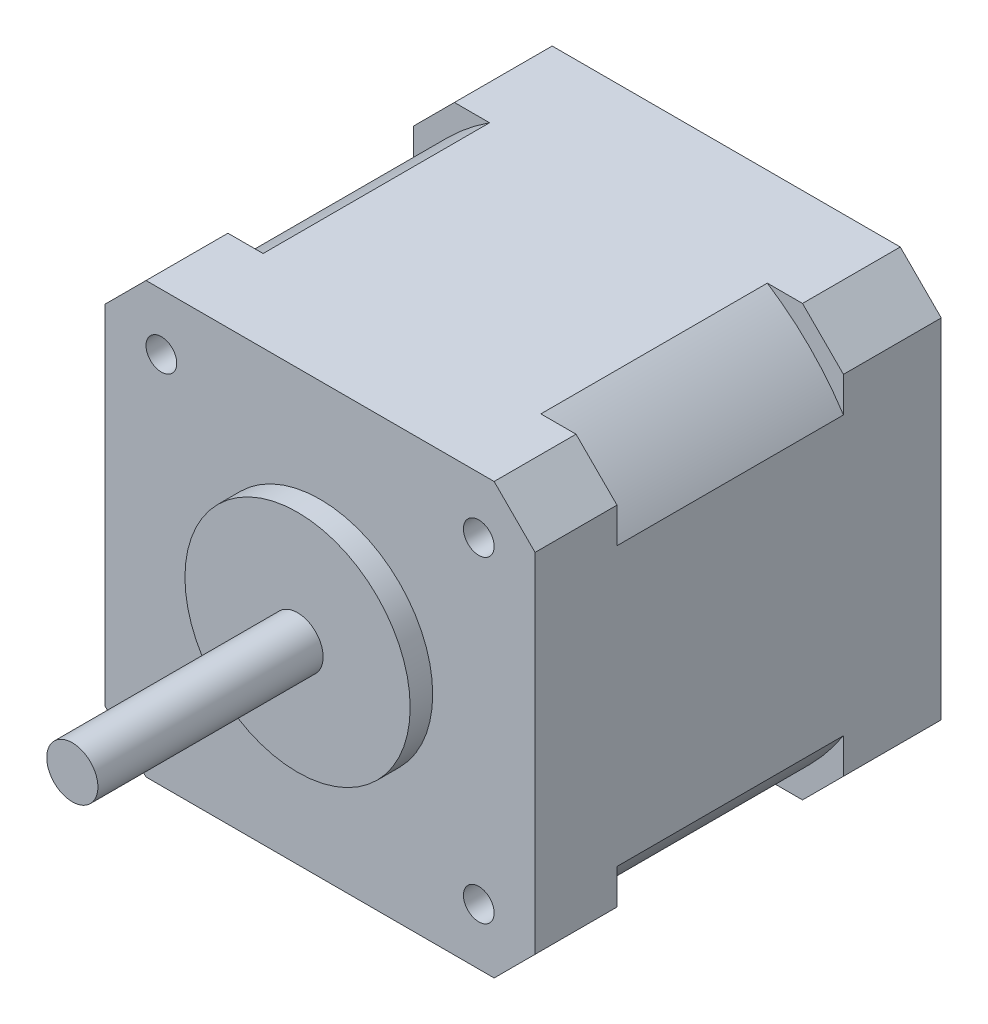
ISO-10303-21;
HEADER;
FILE_DESCRIPTION(('STEP AP214'),'2;1');
FILE_NAME('part.step','',(''),(''),'','','');
FILE_SCHEMA(('AUTOMOTIVE_DESIGN { 1 0 10303 214 1 1 1 1 }'));
ENDSEC;
DATA;
#1=APPLICATION_CONTEXT('core data for automotive mechanical design processes');
#2=APPLICATION_PROTOCOL_DEFINITION('international standard','automotive_design',2000,#1);
#3=PRODUCT_CONTEXT('',#1,'mechanical');
#4=PRODUCT('Part','Part','',(#3));
#5=PRODUCT_RELATED_PRODUCT_CATEGORY('part','',(#4));
#6=PRODUCT_DEFINITION_FORMATION('','',#4);
#7=PRODUCT_DEFINITION_CONTEXT('part definition',#1,'design');
#8=PRODUCT_DEFINITION('design','',#6,#7);
#9=PRODUCT_DEFINITION_SHAPE('','',#8);
#10=(LENGTH_UNIT() NAMED_UNIT(*) SI_UNIT(.MILLI.,.METRE.));
#11=(NAMED_UNIT(*) PLANE_ANGLE_UNIT() SI_UNIT($,.RADIAN.));
#12=(NAMED_UNIT(*) SI_UNIT($,.STERADIAN.) SOLID_ANGLE_UNIT());
#13=UNCERTAINTY_MEASURE_WITH_UNIT(LENGTH_MEASURE(1.E-05),#10,'distance_accuracy_value','');
#14=(GEOMETRIC_REPRESENTATION_CONTEXT(3) GLOBAL_UNCERTAINTY_ASSIGNED_CONTEXT((#13)) GLOBAL_UNIT_ASSIGNED_CONTEXT((#10,
#11,#12)) REPRESENTATION_CONTEXT('',''));
#15=CARTESIAN_POINT('',(0.,0.,0.));
#16=DIRECTION('',(0.,0.,1.));
#17=DIRECTION('',(1.,0.,0.));
#18=AXIS2_PLACEMENT_3D('',#15,#16,#17);
#19=CARTESIAN_POINT('',(0.,0.,2.2));
#20=DIRECTION('',(0.,0.,-1.));
#21=DIRECTION('',(-1.,0.,0.));
#22=AXIS2_PLACEMENT_3D('',#19,#20,#21);
#23=CYLINDRICAL_SURFACE('',#22,11.);
#24=CARTESIAN_POINT('',(0.,0.,2.2));
#25=DIRECTION('',(0.,0.,1.));
#26=DIRECTION('',(1.,0.,0.));
#27=AXIS2_PLACEMENT_3D('',#24,#25,#26);
#28=CIRCLE('',#27,11.);
#29=CARTESIAN_POINT('',(11.,0.,2.2));
#30=VERTEX_POINT('',#29);
#31=EDGE_CURVE('E49',#30,#30,#28,.T.);
#32=ORIENTED_EDGE('',*,*,#31,.F.);
#33=EDGE_LOOP('',(#32));
#34=FACE_BOUND('',#33,.T.);
#35=CARTESIAN_POINT('',(0.,0.,0.));
#36=DIRECTION('',(0.,0.,1.));
#37=DIRECTION('',(1.,0.,0.));
#38=AXIS2_PLACEMENT_3D('',#35,#36,#37);
#39=CIRCLE('',#38,11.);
#40=CARTESIAN_POINT('',(11.,0.,0.));
#41=VERTEX_POINT('',#40);
#42=EDGE_CURVE('E45',#41,#41,#39,.T.);
#43=ORIENTED_EDGE('',*,*,#42,.T.);
#44=EDGE_LOOP('',(#43));
#45=FACE_BOUND('',#44,.T.);
#46=ADVANCED_FACE('F42',(#34,#45),#23,.T.);
#47=CARTESIAN_POINT('',(0.,0.,2.2));
#48=DIRECTION('',(0.,0.,1.));
#49=DIRECTION('',(1.,0.,0.));
#50=AXIS2_PLACEMENT_3D('',#47,#48,#49);
#51=PLANE('',#50);
#52=CARTESIAN_POINT('',(0.,0.,2.19999999999999));
#53=DIRECTION('',(0.,0.,1.));
#54=DIRECTION('',(1.,0.,0.));
#55=AXIS2_PLACEMENT_3D('',#52,#53,#54);
#56=CIRCLE('',#55,2.5);
#57=CARTESIAN_POINT('',(2.5,0.,2.19999999999999));
#58=VERTEX_POINT('',#57);
#59=EDGE_CURVE('E12',#58,#58,#56,.T.);
#60=ORIENTED_EDGE('',*,*,#59,.F.);
#61=EDGE_LOOP('',(#60));
#62=FACE_BOUND('',#61,.T.);
#63=ORIENTED_EDGE('',*,*,#31,.T.);
#64=EDGE_LOOP('',(#63));
#65=FACE_BOUND('',#64,.T.);
#66=ADVANCED_FACE('F66',(#62,#65),#51,.T.);
#67=CARTESIAN_POINT('',(0.,0.,0.));
#68=DIRECTION('',(0.,0.,1.));
#69=DIRECTION('',(1.,0.,0.));
#70=AXIS2_PLACEMENT_3D('',#67,#68,#69);
#71=PLANE('',#70);
#72=ORIENTED_EDGE('',*,*,#42,.F.);
#73=EDGE_LOOP('',(#72));
#74=FACE_BOUND('',#73,.T.);
#75=ADVANCED_FACE('F63',(#74),#71,.F.);
#76=CARTESIAN_POINT('',(0.,0.,31.2710678118655));
#77=DIRECTION('',(0.,0.,-1.));
#78=DIRECTION('',(-1.,0.,0.));
#79=AXIS2_PLACEMENT_3D('',#76,#77,#78);
#80=CYLINDRICAL_SURFACE('',#79,2.5);
#81=ORIENTED_EDGE('',*,*,#59,.T.);
#82=EDGE_LOOP('',(#81));
#83=FACE_BOUND('',#82,.T.);
#84=CARTESIAN_POINT('',(0.,0.,24.2));
#85=DIRECTION('',(0.,0.,1.));
#86=DIRECTION('',(1.,0.,0.));
#87=AXIS2_PLACEMENT_3D('',#84,#85,#86);
#88=CIRCLE('',#87,2.5);
#89=CARTESIAN_POINT('',(2.5,0.,24.2));
#90=VERTEX_POINT('',#89);
#91=EDGE_CURVE('E55',#90,#90,#88,.T.);
#92=ORIENTED_EDGE('',*,*,#91,.F.);
#93=EDGE_LOOP('',(#92));
#94=FACE_BOUND('',#93,.T.);
#95=ADVANCED_FACE('F65',(#83,#94),#80,.T.);
#96=CARTESIAN_POINT('',(0.,0.,24.2));
#97=DIRECTION('',(0.,0.,1.));
#98=DIRECTION('',(1.,0.,0.));
#99=AXIS2_PLACEMENT_3D('',#96,#97,#98);
#100=PLANE('',#99);
#101=ORIENTED_EDGE('',*,*,#91,.T.);
#102=EDGE_LOOP('',(#101));
#103=FACE_BOUND('',#102,.T.);
#104=ADVANCED_FACE('F71',(#103),#100,.T.);
#105=CLOSED_SHELL('',(#46,#66,#75,#95,#104));
#106=MANIFOLD_SOLID_BREP('B2',#105);
#107=CARTESIAN_POINT('',(-21.,-17.,-99.06696961967));
#108=DIRECTION('',(-0.707106781186547,-0.707106781186547,0.));
#109=DIRECTION('',(0.707106781186548,-0.707106781186548,0.));
#110=AXIS2_PLACEMENT_3D('',#107,#108,#109);
#111=PLANE('',#110);
#112=DIRECTION('',(0.,0.,1.));
#113=VECTOR('',#112,1.);
#114=CARTESIAN_POINT('',(-17.,-21.,-99.06696961967));
#115=LINE('',#114,#113);
#116=CARTESIAN_POINT('',(-17.,-21.,-39.67));
#117=VERTEX_POINT('',#116);
#118=CARTESIAN_POINT('',(-17.,-21.,-30.12));
#119=VERTEX_POINT('',#118);
#120=EDGE_CURVE('E432',#117,#119,#115,.T.);
#121=ORIENTED_EDGE('',*,*,#120,.T.);
#122=DIRECTION('',(-0.707106781186548,0.707106781186548,0.));
#123=VECTOR('',#122,1.);
#124=CARTESIAN_POINT('',(-21.,-17.,-30.12));
#125=LINE('',#124,#123);
#126=CARTESIAN_POINT('',(-21.,-17.,-30.12));
#127=VERTEX_POINT('',#126);
#128=EDGE_CURVE('E348',#119,#127,#125,.T.);
#129=ORIENTED_EDGE('',*,*,#128,.T.);
#130=DIRECTION('',(0.,0.,1.));
#131=VECTOR('',#130,1.);
#132=CARTESIAN_POINT('',(-21.,-17.,-99.06696961967));
#133=LINE('',#132,#131);
#134=CARTESIAN_POINT('',(-21.,-17.,-39.67));
#135=VERTEX_POINT('',#134);
#136=EDGE_CURVE('E387',#135,#127,#133,.T.);
#137=ORIENTED_EDGE('',*,*,#136,.F.);
#138=DIRECTION('',(-0.707106781186548,0.707106781186548,0.));
#139=VECTOR('',#138,1.);
#140=CARTESIAN_POINT('',(-21.,-17.,-39.67));
#141=LINE('',#140,#139);
#142=EDGE_CURVE('E447',#117,#135,#141,.T.);
#143=ORIENTED_EDGE('',*,*,#142,.F.);
#144=EDGE_LOOP('',(#121,#129,#137,#143));
#145=FACE_BOUND('',#144,.T.);
#146=ADVANCED_FACE('F113',(#145),#111,.T.);
#147=CARTESIAN_POINT('',(-17.,21.,-99.06696961967));
#148=DIRECTION('',(-0.707106781186547,0.707106781186547,0.));
#149=DIRECTION('',(-0.707106781186548,-0.707106781186548,0.));
#150=AXIS2_PLACEMENT_3D('',#147,#148,#149);
#151=PLANE('',#150);
#152=DIRECTION('',(0.,0.,1.));
#153=VECTOR('',#152,1.);
#154=CARTESIAN_POINT('',(-21.,17.,-99.06696961967));
#155=LINE('',#154,#153);
#156=CARTESIAN_POINT('',(-21.,17.,-39.67));
#157=VERTEX_POINT('',#156);
#158=CARTESIAN_POINT('',(-21.,17.,-30.12));
#159=VERTEX_POINT('',#158);
#160=EDGE_CURVE('E380',#157,#159,#155,.T.);
#161=ORIENTED_EDGE('',*,*,#160,.T.);
#162=DIRECTION('',(0.707106781186548,0.707106781186548,0.));
#163=VECTOR('',#162,1.);
#164=CARTESIAN_POINT('',(-17.,21.,-30.12));
#165=LINE('',#164,#163);
#166=CARTESIAN_POINT('',(-17.,21.,-30.12));
#167=VERTEX_POINT('',#166);
#168=EDGE_CURVE('E356',#159,#167,#165,.T.);
#169=ORIENTED_EDGE('',*,*,#168,.T.);
#170=DIRECTION('',(0.,0.,1.));
#171=VECTOR('',#170,1.);
#172=CARTESIAN_POINT('',(-17.,21.,-99.06696961967));
#173=LINE('',#172,#171);
#174=CARTESIAN_POINT('',(-17.,21.,-39.67));
#175=VERTEX_POINT('',#174);
#176=EDGE_CURVE('E370',#175,#167,#173,.T.);
#177=ORIENTED_EDGE('',*,*,#176,.F.);
#178=DIRECTION('',(0.707106781186548,0.707106781186548,0.));
#179=VECTOR('',#178,1.);
#180=CARTESIAN_POINT('',(-17.,21.,-39.67));
#181=LINE('',#180,#179);
#182=EDGE_CURVE('E381',#157,#175,#181,.T.);
#183=ORIENTED_EDGE('',*,*,#182,.F.);
#184=EDGE_LOOP('',(#161,#169,#177,#183));
#185=FACE_BOUND('',#184,.T.);
#186=ADVANCED_FACE('F377',(#185),#151,.T.);
#187=CARTESIAN_POINT('',(21.,17.,-99.06696961967));
#188=DIRECTION('',(0.707106781186547,0.707106781186547,0.));
#189=DIRECTION('',(-0.707106781186548,0.707106781186548,0.));
#190=AXIS2_PLACEMENT_3D('',#187,#188,#189);
#191=PLANE('',#190);
#192=DIRECTION('',(0.,0.,1.));
#193=VECTOR('',#192,1.);
#194=CARTESIAN_POINT('',(17.,21.,-99.06696961967));
#195=LINE('',#194,#193);
#196=CARTESIAN_POINT('',(17.,21.,-39.67));
#197=VERTEX_POINT('',#196);
#198=CARTESIAN_POINT('',(17.,21.,-30.12));
#199=VERTEX_POINT('',#198);
#200=EDGE_CURVE('E393',#197,#199,#195,.T.);
#201=ORIENTED_EDGE('',*,*,#200,.T.);
#202=DIRECTION('',(0.707106781186548,-0.707106781186548,0.));
#203=VECTOR('',#202,1.);
#204=CARTESIAN_POINT('',(21.,17.,-30.12));
#205=LINE('',#204,#203);
#206=CARTESIAN_POINT('',(21.,17.,-30.12));
#207=VERTEX_POINT('',#206);
#208=EDGE_CURVE('E300',#199,#207,#205,.T.);
#209=ORIENTED_EDGE('',*,*,#208,.T.);
#210=DIRECTION('',(0.,0.,1.));
#211=VECTOR('',#210,1.);
#212=CARTESIAN_POINT('',(21.,17.,-99.06696961967));
#213=LINE('',#212,#211);
#214=CARTESIAN_POINT('',(21.,17.,-39.67));
#215=VERTEX_POINT('',#214);
#216=EDGE_CURVE('E299',#215,#207,#213,.T.);
#217=ORIENTED_EDGE('',*,*,#216,.F.);
#218=DIRECTION('',(0.707106781186548,-0.707106781186548,0.));
#219=VECTOR('',#218,1.);
#220=CARTESIAN_POINT('',(21.,17.,-39.67));
#221=LINE('',#220,#219);
#222=EDGE_CURVE('E438',#197,#215,#221,.T.);
#223=ORIENTED_EDGE('',*,*,#222,.F.);
#224=EDGE_LOOP('',(#201,#209,#217,#223));
#225=FACE_BOUND('',#224,.T.);
#226=ADVANCED_FACE('F568',(#225),#191,.T.);
#227=CARTESIAN_POINT('',(17.,-21.,-99.06696961967));
#228=DIRECTION('',(0.707106781186547,-0.707106781186547,0.));
#229=DIRECTION('',(0.707106781186548,0.707106781186548,0.));
#230=AXIS2_PLACEMENT_3D('',#227,#228,#229);
#231=PLANE('',#230);
#232=DIRECTION('',(0.,0.,1.));
#233=VECTOR('',#232,1.);
#234=CARTESIAN_POINT('',(21.,-17.,-99.06696961967));
#235=LINE('',#234,#233);
#236=CARTESIAN_POINT('',(21.,-17.,-39.67));
#237=VERTEX_POINT('',#236);
#238=CARTESIAN_POINT('',(21.,-17.,-30.12));
#239=VERTEX_POINT('',#238);
#240=EDGE_CURVE('E398',#237,#239,#235,.T.);
#241=ORIENTED_EDGE('',*,*,#240,.T.);
#242=DIRECTION('',(-0.707106781186548,-0.707106781186548,0.));
#243=VECTOR('',#242,1.);
#244=CARTESIAN_POINT('',(17.,-21.,-30.12));
#245=LINE('',#244,#243);
#246=CARTESIAN_POINT('',(17.,-21.,-30.12));
#247=VERTEX_POINT('',#246);
#248=EDGE_CURVE('E407',#239,#247,#245,.T.);
#249=ORIENTED_EDGE('',*,*,#248,.T.);
#250=DIRECTION('',(0.,0.,1.));
#251=VECTOR('',#250,1.);
#252=CARTESIAN_POINT('',(17.,-21.,-99.06696961967));
#253=LINE('',#252,#251);
#254=CARTESIAN_POINT('',(17.,-21.,-39.67));
#255=VERTEX_POINT('',#254);
#256=EDGE_CURVE('E401',#255,#247,#253,.T.);
#257=ORIENTED_EDGE('',*,*,#256,.F.);
#258=DIRECTION('',(-0.707106781186548,-0.707106781186548,0.));
#259=VECTOR('',#258,1.);
#260=CARTESIAN_POINT('',(17.,-21.,-39.67));
#261=LINE('',#260,#259);
#262=EDGE_CURVE('E405',#237,#255,#261,.T.);
#263=ORIENTED_EDGE('',*,*,#262,.F.);
#264=EDGE_LOOP('',(#241,#249,#257,#263));
#265=FACE_BOUND('',#264,.T.);
#266=ADVANCED_FACE('F458',(#265),#231,.T.);
#267=CARTESIAN_POINT('',(-17.,-21.,-99.06696961967));
#268=DIRECTION('',(0.,-1.,0.));
#269=DIRECTION('',(0.,0.,-1.));
#270=AXIS2_PLACEMENT_3D('',#267,#268,#269);
#271=PLANE('',#270);
#272=DIRECTION('',(-1.,0.,0.));
#273=VECTOR('',#272,1.);
#274=CARTESIAN_POINT('',(-17.,-21.,-8.00000000000001));
#275=LINE('',#274,#273);
#276=CARTESIAN_POINT('',(-13.5646599662506,-21.,-8.00000000000001));
#277=VERTEX_POINT('',#276);
#278=CARTESIAN_POINT('',(-17.,-21.,-8.00000000000001));
#279=VERTEX_POINT('',#278);
#280=EDGE_CURVE('E322',#277,#279,#275,.T.);
#281=ORIENTED_EDGE('',*,*,#280,.F.);
#282=DIRECTION('',(0.,0.,-1.));
#283=VECTOR('',#282,1.);
#284=CARTESIAN_POINT('',(-13.5646599662506,-21.,-8.00000000000001));
#285=LINE('',#284,#283);
#286=CARTESIAN_POINT('',(-13.5646599662506,-21.,-30.12));
#287=VERTEX_POINT('',#286);
#288=EDGE_CURVE('E331',#287,#277,#285,.F.);
#289=ORIENTED_EDGE('',*,*,#288,.F.);
#290=DIRECTION('',(-1.,0.,0.));
#291=VECTOR('',#290,1.);
#292=CARTESIAN_POINT('',(-17.,-21.,-30.12));
#293=LINE('',#292,#291);
#294=EDGE_CURVE('E307',#287,#119,#293,.T.);
#295=ORIENTED_EDGE('',*,*,#294,.T.);
#296=ORIENTED_EDGE('',*,*,#120,.F.);
#297=DIRECTION('',(-1.,0.,0.));
#298=VECTOR('',#297,1.);
#299=CARTESIAN_POINT('',(-17.,-21.,-39.67));
#300=LINE('',#299,#298);
#301=EDGE_CURVE('E408',#255,#117,#300,.T.);
#302=ORIENTED_EDGE('',*,*,#301,.F.);
#303=ORIENTED_EDGE('',*,*,#256,.T.);
#304=CARTESIAN_POINT('',(13.5646599662506,-21.,-30.12));
#305=VERTEX_POINT('',#304);
#306=EDGE_CURVE('E301',#247,#305,#293,.T.);
#307=ORIENTED_EDGE('',*,*,#306,.T.);
#308=DIRECTION('',(0.,0.,-1.));
#309=VECTOR('',#308,1.);
#310=CARTESIAN_POINT('',(13.5646599662506,-21.,-8.00000000000001));
#311=LINE('',#310,#309);
#312=CARTESIAN_POINT('',(13.5646599662506,-21.,-8.00000000000001));
#313=VERTEX_POINT('',#312);
#314=EDGE_CURVE('E417',#313,#305,#311,.T.);
#315=ORIENTED_EDGE('',*,*,#314,.F.);
#316=CARTESIAN_POINT('',(17.,-21.,-8.00000000000001));
#317=VERTEX_POINT('',#316);
#318=EDGE_CURVE('E337',#317,#313,#275,.T.);
#319=ORIENTED_EDGE('',*,*,#318,.F.);
#320=CARTESIAN_POINT('',(17.,-21.,0.));
#321=VERTEX_POINT('',#320);
#322=EDGE_CURVE('E404',#317,#321,#253,.T.);
#323=ORIENTED_EDGE('',*,*,#322,.T.);
#324=DIRECTION('',(1.,0.,0.));
#325=VECTOR('',#324,1.);
#326=CARTESIAN_POINT('',(-17.,-21.,0.));
#327=LINE('',#326,#325);
#328=CARTESIAN_POINT('',(-17.,-21.,0.));
#329=VERTEX_POINT('',#328);
#330=EDGE_CURVE('E531',#329,#321,#327,.T.);
#331=ORIENTED_EDGE('',*,*,#330,.F.);
#332=EDGE_CURVE('E333',#279,#329,#115,.T.);
#333=ORIENTED_EDGE('',*,*,#332,.F.);
#334=EDGE_LOOP('',(#281,#289,#295,#296,#302,#303,#307,#315,#319,#323,#331,#333));
#335=FACE_BOUND('',#334,.T.);
#336=ADVANCED_FACE('F115',(#335),#271,.T.);
#337=DIRECTION('',(-0.707106781186548,0.707106781186548,0.));
#338=VECTOR('',#337,1.);
#339=CARTESIAN_POINT('',(-21.,-17.,-8.00000000000001));
#340=LINE('',#339,#338);
#341=CARTESIAN_POINT('',(-21.,-17.,-8.00000000000001));
#342=VERTEX_POINT('',#341);
#343=EDGE_CURVE('E335',#279,#342,#340,.T.);
#344=ORIENTED_EDGE('',*,*,#343,.F.);
#345=ORIENTED_EDGE('',*,*,#332,.T.);
#346=DIRECTION('',(0.707106781186548,-0.707106781186548,0.));
#347=VECTOR('',#346,1.);
#348=CARTESIAN_POINT('',(-21.,-17.,0.));
#349=LINE('',#348,#347);
#350=CARTESIAN_POINT('',(-21.,-17.,0.));
#351=VERTEX_POINT('',#350);
#352=EDGE_CURVE('E422',#351,#329,#349,.T.);
#353=ORIENTED_EDGE('',*,*,#352,.F.);
#354=EDGE_CURVE('E384',#342,#351,#133,.T.);
#355=ORIENTED_EDGE('',*,*,#354,.F.);
#356=EDGE_LOOP('',(#344,#345,#353,#355));
#357=FACE_BOUND('',#356,.T.);
#358=ADVANCED_FACE('F556',(#357),#111,.T.);
#359=CARTESIAN_POINT('',(-21.,17.,-99.06696961967));
#360=DIRECTION('',(-1.,0.,0.));
#361=DIRECTION('',(0.,0.,1.));
#362=AXIS2_PLACEMENT_3D('',#359,#360,#361);
#363=PLANE('',#362);
#364=DIRECTION('',(0.,1.,0.));
#365=VECTOR('',#364,1.);
#366=CARTESIAN_POINT('',(-21.,17.,-8.00000000000001));
#367=LINE('',#366,#365);
#368=CARTESIAN_POINT('',(-21.,13.5646599662505,-8.00000000000001));
#369=VERTEX_POINT('',#368);
#370=CARTESIAN_POINT('',(-21.,17.,-8.00000000000001));
#371=VERTEX_POINT('',#370);
#372=EDGE_CURVE('E985',#369,#371,#367,.T.);
#373=ORIENTED_EDGE('',*,*,#372,.F.);
#374=DIRECTION('',(0.,0.,-1.));
#375=VECTOR('',#374,1.);
#376=CARTESIAN_POINT('',(-21.,13.5646599662505,-8.00000000000001));
#377=LINE('',#376,#375);
#378=CARTESIAN_POINT('',(-21.,13.5646599662505,-30.12));
#379=VERTEX_POINT('',#378);
#380=EDGE_CURVE('E966',#379,#369,#377,.F.);
#381=ORIENTED_EDGE('',*,*,#380,.F.);
#382=DIRECTION('',(0.,1.,0.));
#383=VECTOR('',#382,1.);
#384=CARTESIAN_POINT('',(-21.,17.,-30.12));
#385=LINE('',#384,#383);
#386=EDGE_CURVE('E353',#379,#159,#385,.T.);
#387=ORIENTED_EDGE('',*,*,#386,.T.);
#388=ORIENTED_EDGE('',*,*,#160,.F.);
#389=DIRECTION('',(0.,1.,0.));
#390=VECTOR('',#389,1.);
#391=CARTESIAN_POINT('',(-21.,17.,-39.67));
#392=LINE('',#391,#390);
#393=EDGE_CURVE('E446',#135,#157,#392,.T.);
#394=ORIENTED_EDGE('',*,*,#393,.F.);
#395=ORIENTED_EDGE('',*,*,#136,.T.);
#396=CARTESIAN_POINT('',(-21.,-13.5646599662505,-30.12));
#397=VERTEX_POINT('',#396);
#398=EDGE_CURVE('E352',#127,#397,#385,.T.);
#399=ORIENTED_EDGE('',*,*,#398,.T.);
#400=DIRECTION('',(0.,0.,-1.));
#401=VECTOR('',#400,1.);
#402=CARTESIAN_POINT('',(-21.,-13.5646599662505,-8.00000000000001));
#403=LINE('',#402,#401);
#404=CARTESIAN_POINT('',(-21.,-13.5646599662505,-8.00000000000001));
#405=VERTEX_POINT('',#404);
#406=EDGE_CURVE('E965',#405,#397,#403,.T.);
#407=ORIENTED_EDGE('',*,*,#406,.F.);
#408=EDGE_CURVE('E325',#342,#405,#367,.T.);
#409=ORIENTED_EDGE('',*,*,#408,.F.);
#410=ORIENTED_EDGE('',*,*,#354,.T.);
#411=DIRECTION('',(0.,-1.,0.));
#412=VECTOR('',#411,1.);
#413=CARTESIAN_POINT('',(-21.,17.,0.));
#414=LINE('',#413,#412);
#415=CARTESIAN_POINT('',(-21.,17.,0.));
#416=VERTEX_POINT('',#415);
#417=EDGE_CURVE('E424',#416,#351,#414,.T.);
#418=ORIENTED_EDGE('',*,*,#417,.F.);
#419=EDGE_CURVE('E385',#371,#416,#155,.T.);
#420=ORIENTED_EDGE('',*,*,#419,.F.);
#421=EDGE_LOOP('',(#373,#381,#387,#388,#394,#395,#399,#407,#409,#410,#418,#420));
#422=FACE_BOUND('',#421,.T.);
#423=ADVANCED_FACE('F445',(#422),#363,.T.);
#424=DIRECTION('',(0.707106781186548,0.707106781186548,0.));
#425=VECTOR('',#424,1.);
#426=CARTESIAN_POINT('',(-17.,21.,-8.00000000000001));
#427=LINE('',#426,#425);
#428=CARTESIAN_POINT('',(-17.,21.,-8.00000000000001));
#429=VERTEX_POINT('',#428);
#430=EDGE_CURVE('E554',#371,#429,#427,.T.);
#431=ORIENTED_EDGE('',*,*,#430,.F.);
#432=ORIENTED_EDGE('',*,*,#419,.T.);
#433=DIRECTION('',(-0.707106781186548,-0.707106781186548,0.));
#434=VECTOR('',#433,1.);
#435=CARTESIAN_POINT('',(-17.,21.,0.));
#436=LINE('',#435,#434);
#437=CARTESIAN_POINT('',(-17.,21.,0.));
#438=VERTEX_POINT('',#437);
#439=EDGE_CURVE('E429',#438,#416,#436,.T.);
#440=ORIENTED_EDGE('',*,*,#439,.F.);
#441=EDGE_CURVE('E392',#429,#438,#173,.T.);
#442=ORIENTED_EDGE('',*,*,#441,.F.);
#443=EDGE_LOOP('',(#431,#432,#440,#442));
#444=FACE_BOUND('',#443,.T.);
#445=ADVANCED_FACE('F552',(#444),#151,.T.);
#446=CARTESIAN_POINT('',(17.,21.,-99.06696961967));
#447=DIRECTION('',(0.,1.,0.));
#448=DIRECTION('',(0.,0.,1.));
#449=AXIS2_PLACEMENT_3D('',#446,#447,#448);
#450=PLANE('',#449);
#451=DIRECTION('',(1.,0.,0.));
#452=VECTOR('',#451,1.);
#453=CARTESIAN_POINT('',(17.,21.,-8.00000000000001));
#454=LINE('',#453,#452);
#455=CARTESIAN_POINT('',(13.5646599662505,21.,-8.00000000000001));
#456=VERTEX_POINT('',#455);
#457=CARTESIAN_POINT('',(17.,21.,-8.00000000000001));
#458=VERTEX_POINT('',#457);
#459=EDGE_CURVE('E983',#456,#458,#454,.T.);
#460=ORIENTED_EDGE('',*,*,#459,.F.);
#461=DIRECTION('',(0.,0.,-1.));
#462=VECTOR('',#461,1.);
#463=CARTESIAN_POINT('',(13.5646599662505,21.,-8.00000000000001));
#464=LINE('',#463,#462);
#465=CARTESIAN_POINT('',(13.5646599662505,21.,-30.12));
#466=VERTEX_POINT('',#465);
#467=EDGE_CURVE('E338',#466,#456,#464,.F.);
#468=ORIENTED_EDGE('',*,*,#467,.F.);
#469=DIRECTION('',(1.,0.,0.));
#470=VECTOR('',#469,1.);
#471=CARTESIAN_POINT('',(17.,21.,-30.12));
#472=LINE('',#471,#470);
#473=EDGE_CURVE('E289',#466,#199,#472,.T.);
#474=ORIENTED_EDGE('',*,*,#473,.T.);
#475=ORIENTED_EDGE('',*,*,#200,.F.);
#476=DIRECTION('',(1.,0.,0.));
#477=VECTOR('',#476,1.);
#478=CARTESIAN_POINT('',(17.,21.,-39.67));
#479=LINE('',#478,#477);
#480=EDGE_CURVE('E973',#175,#197,#479,.T.);
#481=ORIENTED_EDGE('',*,*,#480,.F.);
#482=ORIENTED_EDGE('',*,*,#176,.T.);
#483=CARTESIAN_POINT('',(-13.5646599662505,21.,-30.12));
#484=VERTEX_POINT('',#483);
#485=EDGE_CURVE('E359',#167,#484,#472,.T.);
#486=ORIENTED_EDGE('',*,*,#485,.T.);
#487=DIRECTION('',(0.,0.,-1.));
#488=VECTOR('',#487,1.);
#489=CARTESIAN_POINT('',(-13.5646599662505,21.,-8.00000000000001));
#490=LINE('',#489,#488);
#491=CARTESIAN_POINT('',(-13.5646599662505,21.,-8.00000000000001));
#492=VERTEX_POINT('',#491);
#493=EDGE_CURVE('E334',#492,#484,#490,.T.);
#494=ORIENTED_EDGE('',*,*,#493,.F.);
#495=EDGE_CURVE('E982',#429,#492,#454,.T.);
#496=ORIENTED_EDGE('',*,*,#495,.F.);
#497=ORIENTED_EDGE('',*,*,#441,.T.);
#498=DIRECTION('',(-1.,0.,0.));
#499=VECTOR('',#498,1.);
#500=CARTESIAN_POINT('',(17.,21.,0.));
#501=LINE('',#500,#499);
#502=CARTESIAN_POINT('',(17.,21.,0.));
#503=VERTEX_POINT('',#502);
#504=EDGE_CURVE('E543',#503,#438,#501,.T.);
#505=ORIENTED_EDGE('',*,*,#504,.F.);
#506=EDGE_CURVE('E395',#458,#503,#195,.T.);
#507=ORIENTED_EDGE('',*,*,#506,.F.);
#508=EDGE_LOOP('',(#460,#468,#474,#475,#481,#482,#486,#494,#496,#497,#505,#507));
#509=FACE_BOUND('',#508,.T.);
#510=ADVANCED_FACE('F366',(#509),#450,.T.);
#511=DIRECTION('',(0.707106781186548,-0.707106781186548,0.));
#512=VECTOR('',#511,1.);
#513=CARTESIAN_POINT('',(21.,17.,-8.00000000000001));
#514=LINE('',#513,#512);
#515=CARTESIAN_POINT('',(21.,17.,-8.00000000000001));
#516=VERTEX_POINT('',#515);
#517=EDGE_CURVE('E346',#458,#516,#514,.T.);
#518=ORIENTED_EDGE('',*,*,#517,.F.);
#519=ORIENTED_EDGE('',*,*,#506,.T.);
#520=DIRECTION('',(-0.707106781186548,0.707106781186548,0.));
#521=VECTOR('',#520,1.);
#522=CARTESIAN_POINT('',(21.,17.,0.));
#523=LINE('',#522,#521);
#524=CARTESIAN_POINT('',(21.,17.,0.));
#525=VERTEX_POINT('',#524);
#526=EDGE_CURVE('E540',#525,#503,#523,.T.);
#527=ORIENTED_EDGE('',*,*,#526,.F.);
#528=EDGE_CURVE('E397',#516,#525,#213,.T.);
#529=ORIENTED_EDGE('',*,*,#528,.F.);
#530=EDGE_LOOP('',(#518,#519,#527,#529));
#531=FACE_BOUND('',#530,.T.);
#532=ADVANCED_FACE('F575',(#531),#191,.T.);
#533=CARTESIAN_POINT('',(21.,-17.,-99.06696961967));
#534=DIRECTION('',(1.,0.,0.));
#535=DIRECTION('',(0.,0.,-1.));
#536=AXIS2_PLACEMENT_3D('',#533,#534,#535);
#537=PLANE('',#536);
#538=DIRECTION('',(0.,-1.,0.));
#539=VECTOR('',#538,1.);
#540=CARTESIAN_POINT('',(21.,-17.,-8.00000000000001));
#541=LINE('',#540,#539);
#542=CARTESIAN_POINT('',(21.,-13.5646599662505,-8.00000000000001));
#543=VERTEX_POINT('',#542);
#544=CARTESIAN_POINT('',(21.,-17.,-8.00000000000001));
#545=VERTEX_POINT('',#544);
#546=EDGE_CURVE('E344',#543,#545,#541,.T.);
#547=ORIENTED_EDGE('',*,*,#546,.F.);
#548=DIRECTION('',(0.,0.,-1.));
#549=VECTOR('',#548,1.);
#550=CARTESIAN_POINT('',(21.,-13.5646599662505,-8.00000000000001));
#551=LINE('',#550,#549);
#552=CARTESIAN_POINT('',(21.,-13.5646599662505,-30.12));
#553=VERTEX_POINT('',#552);
#554=EDGE_CURVE('E40',#553,#543,#551,.F.);
#555=ORIENTED_EDGE('',*,*,#554,.F.);
#556=DIRECTION('',(0.,-1.,0.));
#557=VECTOR('',#556,1.);
#558=CARTESIAN_POINT('',(21.,-17.,-30.12));
#559=LINE('',#558,#557);
#560=EDGE_CURVE('E303',#553,#239,#559,.T.);
#561=ORIENTED_EDGE('',*,*,#560,.T.);
#562=ORIENTED_EDGE('',*,*,#240,.F.);
#563=DIRECTION('',(0.,-1.,0.));
#564=VECTOR('',#563,1.);
#565=CARTESIAN_POINT('',(21.,-17.,-39.67));
#566=LINE('',#565,#564);
#567=EDGE_CURVE('E434',#215,#237,#566,.T.);
#568=ORIENTED_EDGE('',*,*,#567,.F.);
#569=ORIENTED_EDGE('',*,*,#216,.T.);
#570=CARTESIAN_POINT('',(21.,13.5646599662505,-30.12));
#571=VERTEX_POINT('',#570);
#572=EDGE_CURVE('E286',#207,#571,#559,.T.);
#573=ORIENTED_EDGE('',*,*,#572,.T.);
#574=DIRECTION('',(0.,0.,-1.));
#575=VECTOR('',#574,1.);
#576=CARTESIAN_POINT('',(21.,13.5646599662505,-8.00000000000001));
#577=LINE('',#576,#575);
#578=CARTESIAN_POINT('',(21.,13.5646599662505,-8.00000000000001));
#579=VERTEX_POINT('',#578);
#580=EDGE_CURVE('E121',#579,#571,#577,.T.);
#581=ORIENTED_EDGE('',*,*,#580,.F.);
#582=EDGE_CURVE('E343',#516,#579,#541,.T.);
#583=ORIENTED_EDGE('',*,*,#582,.F.);
#584=ORIENTED_EDGE('',*,*,#528,.T.);
#585=DIRECTION('',(0.,1.,0.));
#586=VECTOR('',#585,1.);
#587=CARTESIAN_POINT('',(21.,-17.,0.));
#588=LINE('',#587,#586);
#589=CARTESIAN_POINT('',(21.,-17.,0.));
#590=VERTEX_POINT('',#589);
#591=EDGE_CURVE('E534',#590,#525,#588,.T.);
#592=ORIENTED_EDGE('',*,*,#591,.F.);
#593=EDGE_CURVE('E400',#545,#590,#235,.T.);
#594=ORIENTED_EDGE('',*,*,#593,.F.);
#595=EDGE_LOOP('',(#547,#555,#561,#562,#568,#569,#573,#581,#583,#584,#592,#594));
#596=FACE_BOUND('',#595,.T.);
#597=ADVANCED_FACE('F296',(#596),#537,.T.);
#598=DIRECTION('',(-0.707106781186548,-0.707106781186548,0.));
#599=VECTOR('',#598,1.);
#600=CARTESIAN_POINT('',(17.,-21.,-8.00000000000001));
#601=LINE('',#600,#599);
#602=EDGE_CURVE('E283',#545,#317,#601,.T.);
#603=ORIENTED_EDGE('',*,*,#602,.F.);
#604=ORIENTED_EDGE('',*,*,#593,.T.);
#605=DIRECTION('',(0.707106781186548,0.707106781186548,0.));
#606=VECTOR('',#605,1.);
#607=CARTESIAN_POINT('',(17.,-21.,0.));
#608=LINE('',#607,#606);
#609=EDGE_CURVE('E420',#321,#590,#608,.T.);
#610=ORIENTED_EDGE('',*,*,#609,.F.);
#611=ORIENTED_EDGE('',*,*,#322,.F.);
#612=EDGE_LOOP('',(#603,#604,#610,#611));
#613=FACE_BOUND('',#612,.T.);
#614=ADVANCED_FACE('F418',(#613),#231,.T.);
#615=CARTESIAN_POINT('',(0.,0.,0.));
#616=DIRECTION('',(0.,0.,1.));
#617=DIRECTION('',(1.,0.,0.));
#618=AXIS2_PLACEMENT_3D('',#615,#616,#617);
#619=PLANE('',#618);
#620=CARTESIAN_POINT('',(15.5,15.5,0.));
#621=DIRECTION('',(0.,0.,1.));
#622=DIRECTION('',(1.,0.,0.));
#623=AXIS2_PLACEMENT_3D('',#620,#621,#622);
#624=CIRCLE('',#623,1.5);
#625=CARTESIAN_POINT('',(17.,15.5,0.));
#626=VERTEX_POINT('',#625);
#627=EDGE_CURVE('E507',#626,#626,#624,.T.);
#628=ORIENTED_EDGE('',*,*,#627,.F.);
#629=EDGE_LOOP('',(#628));
#630=FACE_BOUND('',#629,.T.);
#631=CARTESIAN_POINT('',(-15.5,15.5,0.));
#632=DIRECTION('',(0.,0.,1.));
#633=DIRECTION('',(1.,0.,0.));
#634=AXIS2_PLACEMENT_3D('',#631,#632,#633);
#635=CIRCLE('',#634,1.5);
#636=CARTESIAN_POINT('',(-14.,15.5,0.));
#637=VERTEX_POINT('',#636);
#638=EDGE_CURVE('E513',#637,#637,#635,.T.);
#639=ORIENTED_EDGE('',*,*,#638,.F.);
#640=EDGE_LOOP('',(#639));
#641=FACE_BOUND('',#640,.T.);
#642=CARTESIAN_POINT('',(-15.5,-15.5,0.));
#643=DIRECTION('',(0.,0.,1.));
#644=DIRECTION('',(1.,0.,0.));
#645=AXIS2_PLACEMENT_3D('',#642,#643,#644);
#646=CIRCLE('',#645,1.5);
#647=CARTESIAN_POINT('',(-14.,-15.5,0.));
#648=VERTEX_POINT('',#647);
#649=EDGE_CURVE('E501',#648,#648,#646,.T.);
#650=ORIENTED_EDGE('',*,*,#649,.F.);
#651=EDGE_LOOP('',(#650));
#652=FACE_BOUND('',#651,.T.);
#653=CARTESIAN_POINT('',(15.5,-15.5,0.));
#654=DIRECTION('',(0.,0.,1.));
#655=DIRECTION('',(1.,0.,0.));
#656=AXIS2_PLACEMENT_3D('',#653,#654,#655);
#657=CIRCLE('',#656,1.5);
#658=CARTESIAN_POINT('',(17.,-15.5,0.));
#659=VERTEX_POINT('',#658);
#660=EDGE_CURVE('E498',#659,#659,#657,.T.);
#661=ORIENTED_EDGE('',*,*,#660,.F.);
#662=EDGE_LOOP('',(#661));
#663=FACE_BOUND('',#662,.T.);
#664=ORIENTED_EDGE('',*,*,#330,.T.);
#665=ORIENTED_EDGE('',*,*,#609,.T.);
#666=ORIENTED_EDGE('',*,*,#591,.T.);
#667=ORIENTED_EDGE('',*,*,#526,.T.);
#668=ORIENTED_EDGE('',*,*,#504,.T.);
#669=ORIENTED_EDGE('',*,*,#439,.T.);
#670=ORIENTED_EDGE('',*,*,#417,.T.);
#671=ORIENTED_EDGE('',*,*,#352,.T.);
#672=EDGE_LOOP('',(#664,#665,#666,#667,#668,#669,#670,#671));
#673=FACE_BOUND('',#672,.T.);
#674=ADVANCED_FACE('F524',(#630,#641,#652,#663,#673),#619,.T.);
#675=CARTESIAN_POINT('',(0.,0.,-39.67));
#676=DIRECTION('',(0.,0.,1.));
#677=DIRECTION('',(1.,0.,0.));
#678=AXIS2_PLACEMENT_3D('',#675,#676,#677);
#679=PLANE('',#678);
#680=CARTESIAN_POINT('',(0.,0.,-39.67));
#681=DIRECTION('',(0.,0.,-1.));
#682=DIRECTION('',(0.,1.,0.));
#683=AXIS2_PLACEMENT_3D('',#680,#681,#682);
#684=CIRCLE('',#683,4.75);
#685=CARTESIAN_POINT('',(0.,4.75000000000001,-39.67));
#686=VERTEX_POINT('',#685);
#687=EDGE_CURVE('E492',#686,#686,#684,.T.);
#688=ORIENTED_EDGE('',*,*,#687,.F.);
#689=EDGE_LOOP('',(#688));
#690=FACE_BOUND('',#689,.T.);
#691=CARTESIAN_POINT('',(-15.5,-15.5,-39.67));
#692=DIRECTION('',(0.,0.,-1.));
#693=DIRECTION('',(0.,1.,0.));
#694=AXIS2_PLACEMENT_3D('',#691,#692,#693);
#695=CIRCLE('',#694,1.5);
#696=CARTESIAN_POINT('',(-15.5,-14.,-39.67));
#697=VERTEX_POINT('',#696);
#698=EDGE_CURVE('E472',#697,#697,#695,.T.);
#699=ORIENTED_EDGE('',*,*,#698,.F.);
#700=EDGE_LOOP('',(#699));
#701=FACE_BOUND('',#700,.T.);
#702=CARTESIAN_POINT('',(15.5,15.5,-39.67));
#703=DIRECTION('',(0.,0.,-1.));
#704=DIRECTION('',(0.,1.,0.));
#705=AXIS2_PLACEMENT_3D('',#702,#703,#704);
#706=CIRCLE('',#705,1.5);
#707=CARTESIAN_POINT('',(15.5,17.,-39.67));
#708=VERTEX_POINT('',#707);
#709=EDGE_CURVE('E477',#708,#708,#706,.T.);
#710=ORIENTED_EDGE('',*,*,#709,.F.);
#711=EDGE_LOOP('',(#710));
#712=FACE_BOUND('',#711,.T.);
#713=CARTESIAN_POINT('',(15.5,-15.5,-39.67));
#714=DIRECTION('',(0.,0.,-1.));
#715=DIRECTION('',(0.,1.,0.));
#716=AXIS2_PLACEMENT_3D('',#713,#714,#715);
#717=CIRCLE('',#716,1.5);
#718=CARTESIAN_POINT('',(15.5,-14.,-39.67));
#719=VERTEX_POINT('',#718);
#720=EDGE_CURVE('E478',#719,#719,#717,.T.);
#721=ORIENTED_EDGE('',*,*,#720,.F.);
#722=EDGE_LOOP('',(#721));
#723=FACE_BOUND('',#722,.T.);
#724=CARTESIAN_POINT('',(-15.5,15.5,-39.67));
#725=DIRECTION('',(0.,0.,-1.));
#726=DIRECTION('',(0.,1.,0.));
#727=AXIS2_PLACEMENT_3D('',#724,#725,#726);
#728=CIRCLE('',#727,1.5);
#729=CARTESIAN_POINT('',(-15.5,17.,-39.67));
#730=VERTEX_POINT('',#729);
#731=EDGE_CURVE('E467',#730,#730,#728,.T.);
#732=ORIENTED_EDGE('',*,*,#731,.F.);
#733=EDGE_LOOP('',(#732));
#734=FACE_BOUND('',#733,.T.);
#735=ORIENTED_EDGE('',*,*,#301,.T.);
#736=ORIENTED_EDGE('',*,*,#142,.T.);
#737=ORIENTED_EDGE('',*,*,#393,.T.);
#738=ORIENTED_EDGE('',*,*,#182,.T.);
#739=ORIENTED_EDGE('',*,*,#480,.T.);
#740=ORIENTED_EDGE('',*,*,#222,.T.);
#741=ORIENTED_EDGE('',*,*,#567,.T.);
#742=ORIENTED_EDGE('',*,*,#262,.T.);
#743=EDGE_LOOP('',(#735,#736,#737,#738,#739,#740,#741,#742));
#744=FACE_BOUND('',#743,.T.);
#745=ADVANCED_FACE('F527',(#690,#701,#712,#723,#734,#744),#679,.F.);
#746=CARTESIAN_POINT('',(0.,0.,-30.12));
#747=DIRECTION('',(0.,0.,1.));
#748=DIRECTION('',(1.,0.,0.));
#749=AXIS2_PLACEMENT_3D('',#746,#747,#748);
#750=PLANE('',#749);
#751=ORIENTED_EDGE('',*,*,#248,.F.);
#752=ORIENTED_EDGE('',*,*,#560,.F.);
#753=CARTESIAN_POINT('',(0.,0.,-30.12));
#754=DIRECTION('',(0.,0.,1.));
#755=DIRECTION('',(1.,0.,0.));
#756=AXIS2_PLACEMENT_3D('',#753,#754,#755);
#757=CIRCLE('',#756,25.);
#758=EDGE_CURVE('E293',#305,#553,#757,.T.);
#759=ORIENTED_EDGE('',*,*,#758,.F.);
#760=ORIENTED_EDGE('',*,*,#306,.F.);
#761=EDGE_LOOP('',(#751,#752,#759,#760));
#762=FACE_BOUND('',#761,.T.);
#763=ADVANCED_FACE('F460',(#762),#750,.T.);
#764=CARTESIAN_POINT('',(0.,0.,-8.00000000000001));
#765=DIRECTION('',(0.,0.,1.));
#766=DIRECTION('',(1.,0.,0.));
#767=AXIS2_PLACEMENT_3D('',#764,#765,#766);
#768=PLANE('',#767);
#769=ORIENTED_EDGE('',*,*,#318,.T.);
#770=CARTESIAN_POINT('',(0.,0.,-8.00000000000001));
#771=DIRECTION('',(0.,0.,1.));
#772=DIRECTION('',(1.,0.,0.));
#773=AXIS2_PLACEMENT_3D('',#770,#771,#772);
#774=CIRCLE('',#773,25.);
#775=EDGE_CURVE('E290',#313,#543,#774,.T.);
#776=ORIENTED_EDGE('',*,*,#775,.T.);
#777=ORIENTED_EDGE('',*,*,#546,.T.);
#778=ORIENTED_EDGE('',*,*,#602,.T.);
#779=EDGE_LOOP('',(#769,#776,#777,#778));
#780=FACE_BOUND('',#779,.T.);
#781=ADVANCED_FACE('F411',(#780),#768,.F.);
#782=CARTESIAN_POINT('',(0.,0.,-8.00000000000001));
#783=DIRECTION('',(0.,0.,-1.));
#784=DIRECTION('',(-1.,0.,0.));
#785=AXIS2_PLACEMENT_3D('',#782,#783,#784);
#786=CYLINDRICAL_SURFACE('',#785,25.);
#787=ORIENTED_EDGE('',*,*,#314,.T.);
#788=ORIENTED_EDGE('',*,*,#758,.T.);
#789=ORIENTED_EDGE('',*,*,#554,.T.);
#790=ORIENTED_EDGE('',*,*,#775,.F.);
#791=EDGE_LOOP('',(#787,#788,#789,#790));
#792=FACE_BOUND('',#791,.T.);
#793=ADVANCED_FACE('F654',(#792),#786,.T.);
#794=ORIENTED_EDGE('',*,*,#467,.T.);
#795=EDGE_CURVE('E278',#579,#456,#774,.T.);
#796=ORIENTED_EDGE('',*,*,#795,.F.);
#797=ORIENTED_EDGE('',*,*,#580,.T.);
#798=EDGE_CURVE('E275',#571,#466,#757,.T.);
#799=ORIENTED_EDGE('',*,*,#798,.T.);
#800=EDGE_LOOP('',(#794,#796,#797,#799));
#801=FACE_BOUND('',#800,.T.);
#802=ADVANCED_FACE('F274',(#801),#786,.T.);
#803=ORIENTED_EDGE('',*,*,#798,.F.);
#804=ORIENTED_EDGE('',*,*,#572,.F.);
#805=ORIENTED_EDGE('',*,*,#208,.F.);
#806=ORIENTED_EDGE('',*,*,#473,.F.);
#807=EDGE_LOOP('',(#803,#804,#805,#806));
#808=FACE_BOUND('',#807,.T.);
#809=ADVANCED_FACE('F285',(#808),#750,.T.);
#810=ORIENTED_EDGE('',*,*,#459,.T.);
#811=ORIENTED_EDGE('',*,*,#517,.T.);
#812=ORIENTED_EDGE('',*,*,#582,.T.);
#813=ORIENTED_EDGE('',*,*,#795,.T.);
#814=EDGE_LOOP('',(#810,#811,#812,#813));
#815=FACE_BOUND('',#814,.T.);
#816=ADVANCED_FACE('F656',(#815),#768,.F.);
#817=ORIENTED_EDGE('',*,*,#380,.T.);
#818=EDGE_CURVE('E136',#492,#369,#774,.T.);
#819=ORIENTED_EDGE('',*,*,#818,.F.);
#820=ORIENTED_EDGE('',*,*,#493,.T.);
#821=EDGE_CURVE('E291',#484,#379,#757,.T.);
#822=ORIENTED_EDGE('',*,*,#821,.T.);
#823=EDGE_LOOP('',(#817,#819,#820,#822));
#824=FACE_BOUND('',#823,.T.);
#825=ADVANCED_FACE('F673',(#824),#786,.T.);
#826=ORIENTED_EDGE('',*,*,#821,.F.);
#827=ORIENTED_EDGE('',*,*,#485,.F.);
#828=ORIENTED_EDGE('',*,*,#168,.F.);
#829=ORIENTED_EDGE('',*,*,#386,.F.);
#830=EDGE_LOOP('',(#826,#827,#828,#829));
#831=FACE_BOUND('',#830,.T.);
#832=ADVANCED_FACE('F373',(#831),#750,.T.);
#833=ORIENTED_EDGE('',*,*,#372,.T.);
#834=ORIENTED_EDGE('',*,*,#430,.T.);
#835=ORIENTED_EDGE('',*,*,#495,.T.);
#836=ORIENTED_EDGE('',*,*,#818,.T.);
#837=EDGE_LOOP('',(#833,#834,#835,#836));
#838=FACE_BOUND('',#837,.T.);
#839=ADVANCED_FACE('F688',(#838),#768,.F.);
#840=ORIENTED_EDGE('',*,*,#288,.T.);
#841=EDGE_CURVE('E128',#405,#277,#774,.T.);
#842=ORIENTED_EDGE('',*,*,#841,.F.);
#843=ORIENTED_EDGE('',*,*,#406,.T.);
#844=EDGE_CURVE('E464',#397,#287,#757,.T.);
#845=ORIENTED_EDGE('',*,*,#844,.T.);
#846=EDGE_LOOP('',(#840,#842,#843,#845));
#847=FACE_BOUND('',#846,.T.);
#848=ADVANCED_FACE('F665',(#847),#786,.T.);
#849=ORIENTED_EDGE('',*,*,#280,.T.);
#850=ORIENTED_EDGE('',*,*,#343,.T.);
#851=ORIENTED_EDGE('',*,*,#408,.T.);
#852=ORIENTED_EDGE('',*,*,#841,.T.);
#853=EDGE_LOOP('',(#849,#850,#851,#852));
#854=FACE_BOUND('',#853,.T.);
#855=ADVANCED_FACE('F321',(#854),#768,.F.);
#856=ORIENTED_EDGE('',*,*,#844,.F.);
#857=ORIENTED_EDGE('',*,*,#398,.F.);
#858=ORIENTED_EDGE('',*,*,#128,.F.);
#859=ORIENTED_EDGE('',*,*,#294,.F.);
#860=EDGE_LOOP('',(#856,#857,#858,#859));
#861=FACE_BOUND('',#860,.T.);
#862=ADVANCED_FACE('F450',(#861),#750,.T.);
#863=CARTESIAN_POINT('',(-15.5,15.5,-34.67));
#864=DIRECTION('',(0.,0.,-1.));
#865=DIRECTION('',(0.,1.,0.));
#866=AXIS2_PLACEMENT_3D('',#863,#864,#865);
#867=CYLINDRICAL_SURFACE('',#866,1.5);
#868=CARTESIAN_POINT('',(-15.5,15.5,-34.67));
#869=DIRECTION('',(0.,0.,-1.));
#870=DIRECTION('',(0.,1.,0.));
#871=AXIS2_PLACEMENT_3D('',#868,#869,#870);
#872=CIRCLE('',#871,1.5);
#873=CARTESIAN_POINT('',(-15.5,17.,-34.67));
#874=VERTEX_POINT('',#873);
#875=EDGE_CURVE('E465',#874,#874,#872,.T.);
#876=ORIENTED_EDGE('',*,*,#875,.F.);
#877=EDGE_LOOP('',(#876));
#878=FACE_BOUND('',#877,.T.);
#879=ORIENTED_EDGE('',*,*,#731,.T.);
#880=EDGE_LOOP('',(#879));
#881=FACE_BOUND('',#880,.T.);
#882=ADVANCED_FACE('F732',(#878,#881),#867,.F.);
#883=CARTESIAN_POINT('',(-15.5,15.5,-34.67));
#884=DIRECTION('',(0.,0.,-1.));
#885=DIRECTION('',(0.,1.,0.));
#886=AXIS2_PLACEMENT_3D('',#883,#884,#885);
#887=PLANE('',#886);
#888=ORIENTED_EDGE('',*,*,#875,.T.);
#889=EDGE_LOOP('',(#888));
#890=FACE_BOUND('',#889,.T.);
#891=ADVANCED_FACE('F740',(#890),#887,.T.);
#892=CARTESIAN_POINT('',(15.5,-15.5,-34.67));
#893=DIRECTION('',(0.,0.,-1.));
#894=DIRECTION('',(0.,1.,0.));
#895=AXIS2_PLACEMENT_3D('',#892,#893,#894);
#896=CYLINDRICAL_SURFACE('',#895,1.5);
#897=CARTESIAN_POINT('',(15.5,-15.5,-34.67));
#898=DIRECTION('',(0.,0.,-1.));
#899=DIRECTION('',(0.,1.,0.));
#900=AXIS2_PLACEMENT_3D('',#897,#898,#899);
#901=CIRCLE('',#900,1.5);
#902=CARTESIAN_POINT('',(15.5,-14.,-34.67));
#903=VERTEX_POINT('',#902);
#904=EDGE_CURVE('E486',#903,#903,#901,.T.);
#905=ORIENTED_EDGE('',*,*,#904,.F.);
#906=EDGE_LOOP('',(#905));
#907=FACE_BOUND('',#906,.T.);
#908=ORIENTED_EDGE('',*,*,#720,.T.);
#909=EDGE_LOOP('',(#908));
#910=FACE_BOUND('',#909,.T.);
#911=ADVANCED_FACE('F750',(#907,#910),#896,.F.);
#912=CARTESIAN_POINT('',(15.5,-15.5,-34.67));
#913=DIRECTION('',(0.,0.,-1.));
#914=DIRECTION('',(0.,1.,0.));
#915=AXIS2_PLACEMENT_3D('',#912,#913,#914);
#916=PLANE('',#915);
#917=ORIENTED_EDGE('',*,*,#904,.T.);
#918=EDGE_LOOP('',(#917));
#919=FACE_BOUND('',#918,.T.);
#920=ADVANCED_FACE('F759',(#919),#916,.T.);
#921=CARTESIAN_POINT('',(15.5,15.5,-34.67));
#922=DIRECTION('',(0.,0.,-1.));
#923=DIRECTION('',(0.,1.,0.));
#924=AXIS2_PLACEMENT_3D('',#921,#922,#923);
#925=CYLINDRICAL_SURFACE('',#924,1.5);
#926=CARTESIAN_POINT('',(15.5,15.5,-34.67));
#927=DIRECTION('',(0.,0.,-1.));
#928=DIRECTION('',(0.,1.,0.));
#929=AXIS2_PLACEMENT_3D('',#926,#927,#928);
#930=CIRCLE('',#929,1.5);
#931=CARTESIAN_POINT('',(15.5,17.,-34.67));
#932=VERTEX_POINT('',#931);
#933=EDGE_CURVE('E474',#932,#932,#930,.T.);
#934=ORIENTED_EDGE('',*,*,#933,.F.);
#935=EDGE_LOOP('',(#934));
#936=FACE_BOUND('',#935,.T.);
#937=ORIENTED_EDGE('',*,*,#709,.T.);
#938=EDGE_LOOP('',(#937));
#939=FACE_BOUND('',#938,.T.);
#940=ADVANCED_FACE('F769',(#936,#939),#925,.F.);
#941=CARTESIAN_POINT('',(15.5,15.5,-34.67));
#942=DIRECTION('',(0.,0.,-1.));
#943=DIRECTION('',(0.,1.,0.));
#944=AXIS2_PLACEMENT_3D('',#941,#942,#943);
#945=PLANE('',#944);
#946=ORIENTED_EDGE('',*,*,#933,.T.);
#947=EDGE_LOOP('',(#946));
#948=FACE_BOUND('',#947,.T.);
#949=ADVANCED_FACE('F779',(#948),#945,.T.);
#950=CARTESIAN_POINT('',(-15.5,-15.5,-34.67));
#951=DIRECTION('',(0.,0.,-1.));
#952=DIRECTION('',(0.,1.,0.));
#953=AXIS2_PLACEMENT_3D('',#950,#951,#952);
#954=CYLINDRICAL_SURFACE('',#953,1.5);
#955=CARTESIAN_POINT('',(-15.5,-15.5,-34.67));
#956=DIRECTION('',(0.,0.,-1.));
#957=DIRECTION('',(0.,1.,0.));
#958=AXIS2_PLACEMENT_3D('',#955,#956,#957);
#959=CIRCLE('',#958,1.5);
#960=CARTESIAN_POINT('',(-15.5,-14.,-34.67));
#961=VERTEX_POINT('',#960);
#962=EDGE_CURVE('E481',#961,#961,#959,.T.);
#963=ORIENTED_EDGE('',*,*,#962,.F.);
#964=EDGE_LOOP('',(#963));
#965=FACE_BOUND('',#964,.T.);
#966=ORIENTED_EDGE('',*,*,#698,.T.);
#967=EDGE_LOOP('',(#966));
#968=FACE_BOUND('',#967,.T.);
#969=ADVANCED_FACE('F789',(#965,#968),#954,.F.);
#970=CARTESIAN_POINT('',(-15.5,-15.5,-34.67));
#971=DIRECTION('',(0.,0.,-1.));
#972=DIRECTION('',(0.,1.,0.));
#973=AXIS2_PLACEMENT_3D('',#970,#971,#972);
#974=PLANE('',#973);
#975=ORIENTED_EDGE('',*,*,#962,.T.);
#976=EDGE_LOOP('',(#975));
#977=FACE_BOUND('',#976,.T.);
#978=ADVANCED_FACE('F799',(#977),#974,.T.);
#979=CARTESIAN_POINT('',(0.,0.,-37.67));
#980=DIRECTION('',(0.,0.,-1.));
#981=DIRECTION('',(0.,1.,0.));
#982=AXIS2_PLACEMENT_3D('',#979,#980,#981);
#983=CYLINDRICAL_SURFACE('',#982,4.75);
#984=CARTESIAN_POINT('',(0.,0.,-37.67));
#985=DIRECTION('',(0.,0.,-1.));
#986=DIRECTION('',(0.,1.,0.));
#987=AXIS2_PLACEMENT_3D('',#984,#985,#986);
#988=CIRCLE('',#987,4.75);
#989=CARTESIAN_POINT('',(0.,4.75000000000001,-37.67));
#990=VERTEX_POINT('',#989);
#991=EDGE_CURVE('E489',#990,#990,#988,.T.);
#992=ORIENTED_EDGE('',*,*,#991,.F.);
#993=EDGE_LOOP('',(#992));
#994=FACE_BOUND('',#993,.T.);
#995=ORIENTED_EDGE('',*,*,#687,.T.);
#996=EDGE_LOOP('',(#995));
#997=FACE_BOUND('',#996,.T.);
#998=ADVANCED_FACE('F809',(#994,#997),#983,.F.);
#999=CARTESIAN_POINT('',(0.,0.,-37.67));
#1000=DIRECTION('',(0.,0.,-1.));
#1001=DIRECTION('',(0.,1.,0.));
#1002=AXIS2_PLACEMENT_3D('',#999,#1000,#1001);
#1003=PLANE('',#1002);
#1004=ORIENTED_EDGE('',*,*,#991,.T.);
#1005=EDGE_LOOP('',(#1004));
#1006=FACE_BOUND('',#1005,.T.);
#1007=ADVANCED_FACE('F827',(#1006),#1003,.T.);
#1008=CARTESIAN_POINT('',(15.5,-15.5,-5.));
#1009=DIRECTION('',(0.,0.,1.));
#1010=DIRECTION('',(1.,0.,0.));
#1011=AXIS2_PLACEMENT_3D('',#1008,#1009,#1010);
#1012=CYLINDRICAL_SURFACE('',#1011,1.5);
#1013=CARTESIAN_POINT('',(15.5,-15.5,-5.));
#1014=DIRECTION('',(0.,0.,1.));
#1015=DIRECTION('',(1.,0.,0.));
#1016=AXIS2_PLACEMENT_3D('',#1013,#1014,#1015);
#1017=CIRCLE('',#1016,1.5);
#1018=CARTESIAN_POINT('',(17.,-15.5,-5.));
#1019=VERTEX_POINT('',#1018);
#1020=EDGE_CURVE('E495',#1019,#1019,#1017,.T.);
#1021=ORIENTED_EDGE('',*,*,#1020,.F.);
#1022=EDGE_LOOP('',(#1021));
#1023=FACE_BOUND('',#1022,.T.);
#1024=ORIENTED_EDGE('',*,*,#660,.T.);
#1025=EDGE_LOOP('',(#1024));
#1026=FACE_BOUND('',#1025,.T.);
#1027=ADVANCED_FACE('F836',(#1023,#1026),#1012,.F.);
#1028=CARTESIAN_POINT('',(15.5,-15.5,-5.));
#1029=DIRECTION('',(0.,0.,1.));
#1030=DIRECTION('',(1.,0.,0.));
#1031=AXIS2_PLACEMENT_3D('',#1028,#1029,#1030);
#1032=PLANE('',#1031);
#1033=ORIENTED_EDGE('',*,*,#1020,.T.);
#1034=EDGE_LOOP('',(#1033));
#1035=FACE_BOUND('',#1034,.T.);
#1036=ADVANCED_FACE('F849',(#1035),#1032,.T.);
#1037=CARTESIAN_POINT('',(-15.5,-15.5,-5.));
#1038=DIRECTION('',(0.,0.,1.));
#1039=DIRECTION('',(1.,0.,0.));
#1040=AXIS2_PLACEMENT_3D('',#1037,#1038,#1039);
#1041=CYLINDRICAL_SURFACE('',#1040,1.5);
#1042=CARTESIAN_POINT('',(-15.5,-15.5,-5.));
#1043=DIRECTION('',(0.,0.,1.));
#1044=DIRECTION('',(1.,0.,0.));
#1045=AXIS2_PLACEMENT_3D('',#1042,#1043,#1044);
#1046=CIRCLE('',#1045,1.5);
#1047=CARTESIAN_POINT('',(-14.,-15.5,-5.));
#1048=VERTEX_POINT('',#1047);
#1049=EDGE_CURVE('E516',#1048,#1048,#1046,.T.);
#1050=ORIENTED_EDGE('',*,*,#1049,.F.);
#1051=EDGE_LOOP('',(#1050));
#1052=FACE_BOUND('',#1051,.T.);
#1053=ORIENTED_EDGE('',*,*,#649,.T.);
#1054=EDGE_LOOP('',(#1053));
#1055=FACE_BOUND('',#1054,.T.);
#1056=ADVANCED_FACE('F522',(#1052,#1055),#1041,.F.);
#1057=CARTESIAN_POINT('',(-15.5,-15.5,-5.));
#1058=DIRECTION('',(0.,0.,1.));
#1059=DIRECTION('',(1.,0.,0.));
#1060=AXIS2_PLACEMENT_3D('',#1057,#1058,#1059);
#1061=PLANE('',#1060);
#1062=ORIENTED_EDGE('',*,*,#1049,.T.);
#1063=EDGE_LOOP('',(#1062));
#1064=FACE_BOUND('',#1063,.T.);
#1065=ADVANCED_FACE('F868',(#1064),#1061,.T.);
#1066=CARTESIAN_POINT('',(-15.5,15.5,-5.));
#1067=DIRECTION('',(0.,0.,1.));
#1068=DIRECTION('',(1.,0.,0.));
#1069=AXIS2_PLACEMENT_3D('',#1066,#1067,#1068);
#1070=CYLINDRICAL_SURFACE('',#1069,1.5);
#1071=CARTESIAN_POINT('',(-15.5,15.5,-5.));
#1072=DIRECTION('',(0.,0.,1.));
#1073=DIRECTION('',(1.,0.,0.));
#1074=AXIS2_PLACEMENT_3D('',#1071,#1072,#1073);
#1075=CIRCLE('',#1074,1.5);
#1076=CARTESIAN_POINT('',(-14.,15.5,-5.));
#1077=VERTEX_POINT('',#1076);
#1078=EDGE_CURVE('E510',#1077,#1077,#1075,.T.);
#1079=ORIENTED_EDGE('',*,*,#1078,.F.);
#1080=EDGE_LOOP('',(#1079));
#1081=FACE_BOUND('',#1080,.T.);
#1082=ORIENTED_EDGE('',*,*,#638,.T.);
#1083=EDGE_LOOP('',(#1082));
#1084=FACE_BOUND('',#1083,.T.);
#1085=ADVANCED_FACE('F878',(#1081,#1084),#1070,.F.);
#1086=CARTESIAN_POINT('',(-15.5,15.5,-5.));
#1087=DIRECTION('',(0.,0.,1.));
#1088=DIRECTION('',(1.,0.,0.));
#1089=AXIS2_PLACEMENT_3D('',#1086,#1087,#1088);
#1090=PLANE('',#1089);
#1091=ORIENTED_EDGE('',*,*,#1078,.T.);
#1092=EDGE_LOOP('',(#1091));
#1093=FACE_BOUND('',#1092,.T.);
#1094=ADVANCED_FACE('F888',(#1093),#1090,.T.);
#1095=CARTESIAN_POINT('',(15.5,15.5,-5.));
#1096=DIRECTION('',(0.,0.,1.));
#1097=DIRECTION('',(1.,0.,0.));
#1098=AXIS2_PLACEMENT_3D('',#1095,#1096,#1097);
#1099=CYLINDRICAL_SURFACE('',#1098,1.5);
#1100=CARTESIAN_POINT('',(15.5,15.5,-5.));
#1101=DIRECTION('',(0.,0.,1.));
#1102=DIRECTION('',(1.,0.,0.));
#1103=AXIS2_PLACEMENT_3D('',#1100,#1101,#1102);
#1104=CIRCLE('',#1103,1.5);
#1105=CARTESIAN_POINT('',(17.,15.5,-5.));
#1106=VERTEX_POINT('',#1105);
#1107=EDGE_CURVE('E504',#1106,#1106,#1104,.T.);
#1108=ORIENTED_EDGE('',*,*,#1107,.F.);
#1109=EDGE_LOOP('',(#1108));
#1110=FACE_BOUND('',#1109,.T.);
#1111=ORIENTED_EDGE('',*,*,#627,.T.);
#1112=EDGE_LOOP('',(#1111));
#1113=FACE_BOUND('',#1112,.T.);
#1114=ADVANCED_FACE('F898',(#1110,#1113),#1099,.F.);
#1115=CARTESIAN_POINT('',(15.5,15.5,-5.));
#1116=DIRECTION('',(0.,0.,1.));
#1117=DIRECTION('',(1.,0.,0.));
#1118=AXIS2_PLACEMENT_3D('',#1115,#1116,#1117);
#1119=PLANE('',#1118);
#1120=ORIENTED_EDGE('',*,*,#1107,.T.);
#1121=EDGE_LOOP('',(#1120));
#1122=FACE_BOUND('',#1121,.T.);
#1123=ADVANCED_FACE('F908',(#1122),#1119,.T.);
#1124=CLOSED_SHELL('',(#146,#186,#226,#266,#336,#358,#423,#445,#510,#532,#597,#614,#674,#745,
#763,#781,#793,#802,#809,#816,#825,#832,#839,#848,#855,#862,#882,#891,#911,#920,#940,#949,#969,
#978,#998,#1007,#1027,#1036,#1056,#1065,#1085,#1094,#1114,#1123));
#1125=MANIFOLD_SOLID_BREP('B7',#1124);
#1126=ADVANCED_BREP_SHAPE_REPRESENTATION('',(#18,#106,#1125),#14);
#1127=SHAPE_DEFINITION_REPRESENTATION(#9,#1126);
ENDSEC;
END-ISO-10303-21;
